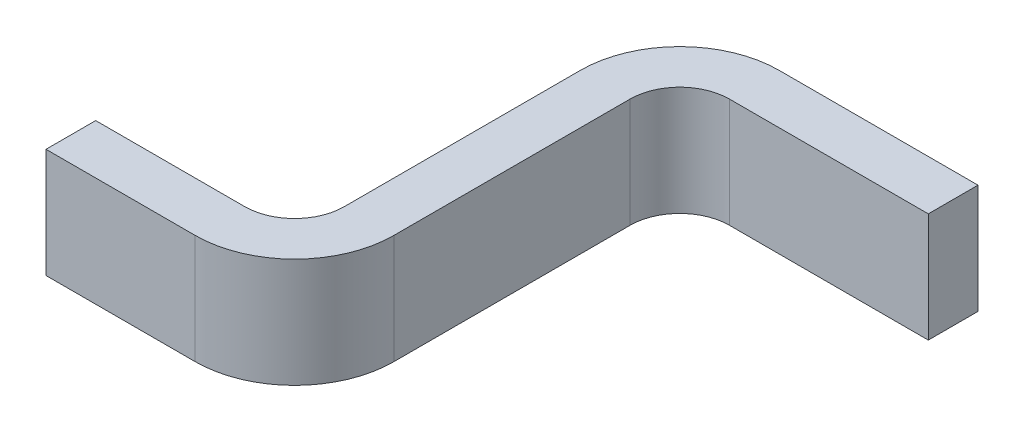
ISO-10303-21;
HEADER;
FILE_DESCRIPTION(('STEP AP214'),'2;1');
FILE_NAME('part.step','',(''),(''),'','','');
FILE_SCHEMA(('AUTOMOTIVE_DESIGN { 1 0 10303 214 1 1 1 1 }'));
ENDSEC;
DATA;
#1=APPLICATION_CONTEXT('core data for automotive mechanical design processes');
#2=APPLICATION_PROTOCOL_DEFINITION('international standard','automotive_design',2000,#1);
#3=PRODUCT_CONTEXT('',#1,'mechanical');
#4=PRODUCT('Part','Part','',(#3));
#5=PRODUCT_RELATED_PRODUCT_CATEGORY('part','',(#4));
#6=PRODUCT_DEFINITION_FORMATION('','',#4);
#7=PRODUCT_DEFINITION_CONTEXT('part definition',#1,'design');
#8=PRODUCT_DEFINITION('design','',#6,#7);
#9=PRODUCT_DEFINITION_SHAPE('','',#8);
#10=(LENGTH_UNIT() NAMED_UNIT(*) SI_UNIT(.MILLI.,.METRE.));
#11=(NAMED_UNIT(*) PLANE_ANGLE_UNIT() SI_UNIT($,.RADIAN.));
#12=(NAMED_UNIT(*) SI_UNIT($,.STERADIAN.) SOLID_ANGLE_UNIT());
#13=UNCERTAINTY_MEASURE_WITH_UNIT(LENGTH_MEASURE(1.E-05),#10,'distance_accuracy_value','');
#14=(GEOMETRIC_REPRESENTATION_CONTEXT(3) GLOBAL_UNCERTAINTY_ASSIGNED_CONTEXT((#13)) GLOBAL_UNIT_ASSIGNED_CONTEXT((#10,
#11,#12)) REPRESENTATION_CONTEXT('',''));
#15=CARTESIAN_POINT('',(0.,0.,0.));
#16=DIRECTION('',(0.,0.,1.));
#17=DIRECTION('',(1.,0.,0.));
#18=AXIS2_PLACEMENT_3D('',#15,#16,#17);
#19=CARTESIAN_POINT('',(3.90000000000001,-0.640000000000001,0.675));
#20=DIRECTION('',(0.,-1.,0.));
#21=DIRECTION('',(0.,0.,-1.));
#22=AXIS2_PLACEMENT_3D('',#19,#20,#21);
#23=PLANE('',#22);
#24=CARTESIAN_POINT('',(3.8,-0.640000000000001,0.675));
#25=DIRECTION('',(0.,-1.,0.));
#26=DIRECTION('',(0.,0.,-1.));
#27=AXIS2_PLACEMENT_3D('',#24,#25,#26);
#28=CIRCLE('',#27,0.1);
#29=CARTESIAN_POINT('',(3.90000000000001,-0.640000000000001,0.675));
#30=VERTEX_POINT('',#29);
#31=CARTESIAN_POINT('',(3.8,-0.640000000000001,0.775));
#32=VERTEX_POINT('',#31);
#33=EDGE_CURVE('E162',#30,#32,#28,.T.);
#34=ORIENTED_EDGE('',*,*,#33,.T.);
#35=DIRECTION('',(1.,0.,0.));
#36=VECTOR('',#35,1.);
#37=CARTESIAN_POINT('',(3.50000000000001,-0.64,0.775));
#38=LINE('',#37,#36);
#39=CARTESIAN_POINT('',(3.50000000000001,-0.64,0.775));
#40=VERTEX_POINT('',#39);
#41=EDGE_CURVE('E120',#32,#40,#38,.F.);
#42=ORIENTED_EDGE('',*,*,#41,.T.);
#43=DIRECTION('',(0.,0.,1.));
#44=VECTOR('',#43,1.);
#45=CARTESIAN_POINT('',(3.50000000000001,-0.64,0.775));
#46=LINE('',#45,#44);
#47=CARTESIAN_POINT('',(3.50000000000001,-0.64,0.875));
#48=VERTEX_POINT('',#47);
#49=EDGE_CURVE('E116',#48,#40,#46,.F.);
#50=ORIENTED_EDGE('',*,*,#49,.F.);
#51=DIRECTION('',(-1.,0.,0.));
#52=VECTOR('',#51,1.);
#53=CARTESIAN_POINT('',(3.50000000000001,-0.64,0.875));
#54=LINE('',#53,#52);
#55=CARTESIAN_POINT('',(3.8,-0.640000000000001,0.875));
#56=VERTEX_POINT('',#55);
#57=EDGE_CURVE('E111',#48,#56,#54,.F.);
#58=ORIENTED_EDGE('',*,*,#57,.T.);
#59=CARTESIAN_POINT('',(3.8,-0.640000000000001,0.675));
#60=DIRECTION('',(0.,-1.,0.));
#61=DIRECTION('',(0.,0.,-1.));
#62=AXIS2_PLACEMENT_3D('',#59,#60,#61);
#63=CIRCLE('',#62,0.2);
#64=CARTESIAN_POINT('',(4.,-0.64,0.675));
#65=VERTEX_POINT('',#64);
#66=EDGE_CURVE('E102',#65,#56,#63,.T.);
#67=ORIENTED_EDGE('',*,*,#66,.F.);
#68=DIRECTION('',(0.,0.,1.));
#69=VECTOR('',#68,1.);
#70=CARTESIAN_POINT('',(4.,-0.64,0.675));
#71=LINE('',#70,#69);
#72=CARTESIAN_POINT('',(4.,-0.64,0.2));
#73=VERTEX_POINT('',#72);
#74=EDGE_CURVE('E98',#65,#73,#71,.F.);
#75=ORIENTED_EDGE('',*,*,#74,.T.);
#76=CARTESIAN_POINT('',(4.1,-0.64,0.2));
#77=DIRECTION('',(0.,1.,0.));
#78=DIRECTION('',(0.,0.,1.));
#79=AXIS2_PLACEMENT_3D('',#76,#77,#78);
#80=CIRCLE('',#79,0.1);
#81=CARTESIAN_POINT('',(4.1,-0.64,0.1));
#82=VERTEX_POINT('',#81);
#83=EDGE_CURVE('E20',#73,#82,#80,.F.);
#84=ORIENTED_EDGE('',*,*,#83,.T.);
#85=DIRECTION('',(-1.,0.,0.));
#86=VECTOR('',#85,1.);
#87=CARTESIAN_POINT('',(4.1,-0.64,0.1));
#88=LINE('',#87,#86);
#89=CARTESIAN_POINT('',(4.5,-0.64,0.1));
#90=VERTEX_POINT('',#89);
#91=EDGE_CURVE('E145',#82,#90,#88,.F.);
#92=ORIENTED_EDGE('',*,*,#91,.T.);
#93=DIRECTION('',(0.,0.,1.));
#94=VECTOR('',#93,1.);
#95=CARTESIAN_POINT('',(4.5,-0.64,0.));
#96=LINE('',#95,#94);
#97=CARTESIAN_POINT('',(4.5,-0.64,0.));
#98=VERTEX_POINT('',#97);
#99=EDGE_CURVE('E139',#90,#98,#96,.F.);
#100=ORIENTED_EDGE('',*,*,#99,.T.);
#101=DIRECTION('',(1.,0.,0.));
#102=VECTOR('',#101,1.);
#103=CARTESIAN_POINT('',(4.1,-0.64,0.));
#104=LINE('',#103,#102);
#105=CARTESIAN_POINT('',(4.1,-0.64,0.));
#106=VERTEX_POINT('',#105);
#107=EDGE_CURVE('E132',#98,#106,#104,.F.);
#108=ORIENTED_EDGE('',*,*,#107,.T.);
#109=CARTESIAN_POINT('',(4.1,-0.64,0.2));
#110=DIRECTION('',(0.,1.,0.));
#111=DIRECTION('',(0.,0.,1.));
#112=AXIS2_PLACEMENT_3D('',#109,#110,#111);
#113=CIRCLE('',#112,0.2);
#114=CARTESIAN_POINT('',(3.90000000000001,-0.640000000000001,0.2));
#115=VERTEX_POINT('',#114);
#116=EDGE_CURVE('E135',#115,#106,#113,.F.);
#117=ORIENTED_EDGE('',*,*,#116,.F.);
#118=DIRECTION('',(0.,0.,-1.));
#119=VECTOR('',#118,1.);
#120=CARTESIAN_POINT('',(3.90000000000001,-0.640000000000001,0.675));
#121=LINE('',#120,#119);
#122=EDGE_CURVE('E128',#115,#30,#121,.F.);
#123=ORIENTED_EDGE('',*,*,#122,.T.);
#124=EDGE_LOOP('',(#34,#42,#50,#58,#67,#75,#84,#92,#100,#108,#117,#123));
#125=FACE_BOUND('',#124,.T.);
#126=ADVANCED_FACE('F17',(#125),#23,.F.);
#127=CARTESIAN_POINT('',(4.1,-0.64,0.2));
#128=DIRECTION('',(0.,1.,0.));
#129=DIRECTION('',(0.,0.,1.));
#130=AXIS2_PLACEMENT_3D('',#127,#128,#129);
#131=CYLINDRICAL_SURFACE('',#130,0.1);
#132=DIRECTION('',(0.,1.,0.));
#133=VECTOR('',#132,1.);
#134=CARTESIAN_POINT('',(4.,-0.64,0.2));
#135=LINE('',#134,#133);
#136=CARTESIAN_POINT('',(4.,-0.86,0.2));
#137=VERTEX_POINT('',#136);
#138=EDGE_CURVE('E91',#73,#137,#135,.F.);
#139=ORIENTED_EDGE('',*,*,#138,.T.);
#140=CARTESIAN_POINT('',(4.1,-0.86,0.2));
#141=DIRECTION('',(0.,1.,0.));
#142=DIRECTION('',(0.,0.,1.));
#143=AXIS2_PLACEMENT_3D('',#140,#141,#142);
#144=CIRCLE('',#143,0.1);
#145=CARTESIAN_POINT('',(4.1,-0.86,0.1));
#146=VERTEX_POINT('',#145);
#147=EDGE_CURVE('E103',#137,#146,#144,.F.);
#148=ORIENTED_EDGE('',*,*,#147,.T.);
#149=DIRECTION('',(0.,1.,0.));
#150=VECTOR('',#149,1.);
#151=CARTESIAN_POINT('',(4.1,-0.64,0.1));
#152=LINE('',#151,#150);
#153=EDGE_CURVE('E92',#146,#82,#152,.T.);
#154=ORIENTED_EDGE('',*,*,#153,.T.);
#155=ORIENTED_EDGE('',*,*,#83,.F.);
#156=EDGE_LOOP('',(#139,#148,#154,#155));
#157=FACE_BOUND('',#156,.T.);
#158=ADVANCED_FACE('F89',(#157),#131,.F.);
#159=CARTESIAN_POINT('',(4.1,-0.64,0.1));
#160=DIRECTION('',(0.,0.,-1.));
#161=DIRECTION('',(-1.,0.,0.));
#162=AXIS2_PLACEMENT_3D('',#159,#160,#161);
#163=PLANE('',#162);
#164=ORIENTED_EDGE('',*,*,#153,.F.);
#165=DIRECTION('',(1.,0.,0.));
#166=VECTOR('',#165,1.);
#167=CARTESIAN_POINT('',(4.,-0.86,0.1));
#168=LINE('',#167,#166);
#169=CARTESIAN_POINT('',(4.5,-0.86,0.1));
#170=VERTEX_POINT('',#169);
#171=EDGE_CURVE('E105',#146,#170,#168,.T.);
#172=ORIENTED_EDGE('',*,*,#171,.T.);
#173=DIRECTION('',(0.,1.,0.));
#174=VECTOR('',#173,1.);
#175=CARTESIAN_POINT('',(4.5,-0.86,0.1));
#176=LINE('',#175,#174);
#177=EDGE_CURVE('E142',#170,#90,#176,.T.);
#178=ORIENTED_EDGE('',*,*,#177,.T.);
#179=ORIENTED_EDGE('',*,*,#91,.F.);
#180=EDGE_LOOP('',(#164,#172,#178,#179));
#181=FACE_BOUND('',#180,.T.);
#182=ADVANCED_FACE('F187',(#181),#163,.F.);
#183=CARTESIAN_POINT('',(4.5,-0.86,0.));
#184=DIRECTION('',(-1.,0.,0.));
#185=DIRECTION('',(0.,0.,1.));
#186=AXIS2_PLACEMENT_3D('',#183,#184,#185);
#187=PLANE('',#186);
#188=ORIENTED_EDGE('',*,*,#177,.F.);
#189=DIRECTION('',(0.,0.,1.));
#190=VECTOR('',#189,1.);
#191=CARTESIAN_POINT('',(4.5,-0.86,0.675));
#192=LINE('',#191,#190);
#193=CARTESIAN_POINT('',(4.5,-0.86,0.));
#194=VERTEX_POINT('',#193);
#195=EDGE_CURVE('E176',#170,#194,#192,.F.);
#196=ORIENTED_EDGE('',*,*,#195,.T.);
#197=DIRECTION('',(0.,1.,0.));
#198=VECTOR('',#197,1.);
#199=CARTESIAN_POINT('',(4.5,-0.86,0.));
#200=LINE('',#199,#198);
#201=EDGE_CURVE('E136',#194,#98,#200,.T.);
#202=ORIENTED_EDGE('',*,*,#201,.T.);
#203=ORIENTED_EDGE('',*,*,#99,.F.);
#204=EDGE_LOOP('',(#188,#196,#202,#203));
#205=FACE_BOUND('',#204,.T.);
#206=ADVANCED_FACE('F192',(#205),#187,.F.);
#207=CARTESIAN_POINT('',(4.1,-0.86,0.));
#208=DIRECTION('',(0.,0.,1.));
#209=DIRECTION('',(1.,0.,0.));
#210=AXIS2_PLACEMENT_3D('',#207,#208,#209);
#211=PLANE('',#210);
#212=DIRECTION('',(0.,1.,0.));
#213=VECTOR('',#212,1.);
#214=CARTESIAN_POINT('',(4.1,-0.86,0.));
#215=LINE('',#214,#213);
#216=CARTESIAN_POINT('',(4.1,-0.86,0.));
#217=VERTEX_POINT('',#216);
#218=EDGE_CURVE('E163',#106,#217,#215,.F.);
#219=ORIENTED_EDGE('',*,*,#218,.F.);
#220=ORIENTED_EDGE('',*,*,#107,.F.);
#221=ORIENTED_EDGE('',*,*,#201,.F.);
#222=DIRECTION('',(1.,0.,0.));
#223=VECTOR('',#222,1.);
#224=CARTESIAN_POINT('',(4.,-0.86,0.));
#225=LINE('',#224,#223);
#226=EDGE_CURVE('E159',#194,#217,#225,.F.);
#227=ORIENTED_EDGE('',*,*,#226,.T.);
#228=EDGE_LOOP('',(#219,#220,#221,#227));
#229=FACE_BOUND('',#228,.T.);
#230=ADVANCED_FACE('F264',(#229),#211,.F.);
#231=CARTESIAN_POINT('',(4.1,-0.86,0.2));
#232=DIRECTION('',(0.,1.,0.));
#233=DIRECTION('',(0.,0.,1.));
#234=AXIS2_PLACEMENT_3D('',#231,#232,#233);
#235=CYLINDRICAL_SURFACE('',#234,0.2);
#236=ORIENTED_EDGE('',*,*,#116,.T.);
#237=ORIENTED_EDGE('',*,*,#218,.T.);
#238=CARTESIAN_POINT('',(4.1,-0.86,0.2));
#239=DIRECTION('',(0.,1.,0.));
#240=DIRECTION('',(0.,0.,1.));
#241=AXIS2_PLACEMENT_3D('',#238,#239,#240);
#242=CIRCLE('',#241,0.2);
#243=CARTESIAN_POINT('',(3.90000000000001,-0.860000000000001,0.2));
#244=VERTEX_POINT('',#243);
#245=EDGE_CURVE('E157',#217,#244,#242,.T.);
#246=ORIENTED_EDGE('',*,*,#245,.T.);
#247=DIRECTION('',(0.,1.,0.));
#248=VECTOR('',#247,1.);
#249=CARTESIAN_POINT('',(3.90000000000001,-0.860000000000001,0.2));
#250=LINE('',#249,#248);
#251=EDGE_CURVE('E131',#244,#115,#250,.T.);
#252=ORIENTED_EDGE('',*,*,#251,.T.);
#253=EDGE_LOOP('',(#236,#237,#246,#252));
#254=FACE_BOUND('',#253,.T.);
#255=ADVANCED_FACE('F266',(#254),#235,.T.);
#256=CARTESIAN_POINT('',(3.90000000000001,-0.860000000000001,0.675));
#257=DIRECTION('',(1.,0.,0.));
#258=DIRECTION('',(0.,0.,-1.));
#259=AXIS2_PLACEMENT_3D('',#256,#257,#258);
#260=PLANE('',#259);
#261=DIRECTION('',(0.,-1.,0.));
#262=VECTOR('',#261,1.);
#263=CARTESIAN_POINT('',(3.90000000000001,-0.860000000000001,0.675));
#264=LINE('',#263,#262);
#265=CARTESIAN_POINT('',(3.90000000000001,-0.860000000000001,0.675));
#266=VERTEX_POINT('',#265);
#267=EDGE_CURVE('E130',#266,#30,#264,.F.);
#268=ORIENTED_EDGE('',*,*,#267,.T.);
#269=ORIENTED_EDGE('',*,*,#122,.F.);
#270=ORIENTED_EDGE('',*,*,#251,.F.);
#271=DIRECTION('',(0.,0.,1.));
#272=VECTOR('',#271,1.);
#273=CARTESIAN_POINT('',(3.90000000000001,-0.860000000000001,0.675));
#274=LINE('',#273,#272);
#275=EDGE_CURVE('E156',#244,#266,#274,.T.);
#276=ORIENTED_EDGE('',*,*,#275,.T.);
#277=EDGE_LOOP('',(#268,#269,#270,#276));
#278=FACE_BOUND('',#277,.T.);
#279=ADVANCED_FACE('F231',(#278),#260,.F.);
#280=CARTESIAN_POINT('',(3.8,-0.860000000000001,0.675));
#281=DIRECTION('',(0.,-1.,0.));
#282=DIRECTION('',(0.,0.,-1.));
#283=AXIS2_PLACEMENT_3D('',#280,#281,#282);
#284=CYLINDRICAL_SURFACE('',#283,0.1);
#285=DIRECTION('',(0.,1.,0.));
#286=VECTOR('',#285,1.);
#287=CARTESIAN_POINT('',(3.8,-0.860000000000001,0.775));
#288=LINE('',#287,#286);
#289=CARTESIAN_POINT('',(3.8,-0.860000000000001,0.775));
#290=VERTEX_POINT('',#289);
#291=EDGE_CURVE('E125',#290,#32,#288,.T.);
#292=ORIENTED_EDGE('',*,*,#291,.T.);
#293=ORIENTED_EDGE('',*,*,#33,.F.);
#294=ORIENTED_EDGE('',*,*,#267,.F.);
#295=CARTESIAN_POINT('',(3.8,-0.860000000000001,0.675));
#296=DIRECTION('',(0.,-1.,0.));
#297=DIRECTION('',(0.,0.,-1.));
#298=AXIS2_PLACEMENT_3D('',#295,#296,#297);
#299=CIRCLE('',#298,0.1);
#300=EDGE_CURVE('E152',#266,#290,#299,.T.);
#301=ORIENTED_EDGE('',*,*,#300,.T.);
#302=EDGE_LOOP('',(#292,#293,#294,#301));
#303=FACE_BOUND('',#302,.T.);
#304=ADVANCED_FACE('F235',(#303),#284,.F.);
#305=CARTESIAN_POINT('',(3.50000000000001,-0.86,0.775));
#306=DIRECTION('',(0.,0.,1.));
#307=DIRECTION('',(1.,0.,0.));
#308=AXIS2_PLACEMENT_3D('',#305,#306,#307);
#309=PLANE('',#308);
#310=DIRECTION('',(0.,1.,0.));
#311=VECTOR('',#310,1.);
#312=CARTESIAN_POINT('',(3.50000000000001,-0.86,0.775));
#313=LINE('',#312,#311);
#314=CARTESIAN_POINT('',(3.50000000000001,-0.86,0.775));
#315=VERTEX_POINT('',#314);
#316=EDGE_CURVE('E119',#40,#315,#313,.F.);
#317=ORIENTED_EDGE('',*,*,#316,.F.);
#318=ORIENTED_EDGE('',*,*,#41,.F.);
#319=ORIENTED_EDGE('',*,*,#291,.F.);
#320=DIRECTION('',(1.,0.,0.));
#321=VECTOR('',#320,1.);
#322=CARTESIAN_POINT('',(4.,-0.86,0.775));
#323=LINE('',#322,#321);
#324=EDGE_CURVE('E155',#290,#315,#323,.F.);
#325=ORIENTED_EDGE('',*,*,#324,.T.);
#326=EDGE_LOOP('',(#317,#318,#319,#325));
#327=FACE_BOUND('',#326,.T.);
#328=ADVANCED_FACE('F259',(#327),#309,.F.);
#329=CARTESIAN_POINT('',(3.50000000000001,-0.86,0.775));
#330=DIRECTION('',(-1.,0.,0.));
#331=DIRECTION('',(0.,0.,1.));
#332=AXIS2_PLACEMENT_3D('',#329,#330,#331);
#333=PLANE('',#332);
#334=DIRECTION('',(0.,0.,1.));
#335=VECTOR('',#334,1.);
#336=CARTESIAN_POINT('',(3.50000000000001,-0.86,0.675));
#337=LINE('',#336,#335);
#338=CARTESIAN_POINT('',(3.50000000000001,-0.86,0.875));
#339=VERTEX_POINT('',#338);
#340=EDGE_CURVE('E217',#315,#339,#337,.T.);
#341=ORIENTED_EDGE('',*,*,#340,.T.);
#342=DIRECTION('',(0.,1.,0.));
#343=VECTOR('',#342,1.);
#344=CARTESIAN_POINT('',(3.50000000000001,-0.64,0.875));
#345=LINE('',#344,#343);
#346=EDGE_CURVE('E113',#339,#48,#345,.T.);
#347=ORIENTED_EDGE('',*,*,#346,.T.);
#348=ORIENTED_EDGE('',*,*,#49,.T.);
#349=ORIENTED_EDGE('',*,*,#316,.T.);
#350=EDGE_LOOP('',(#341,#347,#348,#349));
#351=FACE_BOUND('',#350,.T.);
#352=ADVANCED_FACE('F255',(#351),#333,.T.);
#353=CARTESIAN_POINT('',(3.50000000000001,-0.64,0.875));
#354=DIRECTION('',(0.,0.,-1.));
#355=DIRECTION('',(-1.,0.,0.));
#356=AXIS2_PLACEMENT_3D('',#353,#354,#355);
#357=PLANE('',#356);
#358=ORIENTED_EDGE('',*,*,#346,.F.);
#359=DIRECTION('',(1.,0.,0.));
#360=VECTOR('',#359,1.);
#361=CARTESIAN_POINT('',(4.,-0.86,0.875));
#362=LINE('',#361,#360);
#363=CARTESIAN_POINT('',(3.8,-0.860000000000001,0.875));
#364=VERTEX_POINT('',#363);
#365=EDGE_CURVE('E151',#339,#364,#362,.T.);
#366=ORIENTED_EDGE('',*,*,#365,.T.);
#367=DIRECTION('',(0.,-1.,0.));
#368=VECTOR('',#367,1.);
#369=CARTESIAN_POINT('',(3.8,-0.640000000000001,0.875));
#370=LINE('',#369,#368);
#371=EDGE_CURVE('E99',#56,#364,#370,.T.);
#372=ORIENTED_EDGE('',*,*,#371,.F.);
#373=ORIENTED_EDGE('',*,*,#57,.F.);
#374=EDGE_LOOP('',(#358,#366,#372,#373));
#375=FACE_BOUND('',#374,.T.);
#376=ADVANCED_FACE('F251',(#375),#357,.F.);
#377=CARTESIAN_POINT('',(3.8,-0.640000000000001,0.675));
#378=DIRECTION('',(0.,-1.,0.));
#379=DIRECTION('',(0.,0.,-1.));
#380=AXIS2_PLACEMENT_3D('',#377,#378,#379);
#381=CYLINDRICAL_SURFACE('',#380,0.2);
#382=CARTESIAN_POINT('',(3.8,-0.860000000000001,0.675));
#383=DIRECTION('',(0.,-1.,0.));
#384=DIRECTION('',(0.,0.,-1.));
#385=AXIS2_PLACEMENT_3D('',#382,#383,#384);
#386=CIRCLE('',#385,0.2);
#387=CARTESIAN_POINT('',(4.,-0.86,0.675));
#388=VERTEX_POINT('',#387);
#389=EDGE_CURVE('E26',#364,#388,#386,.F.);
#390=ORIENTED_EDGE('',*,*,#389,.T.);
#391=DIRECTION('',(0.,1.,0.));
#392=VECTOR('',#391,1.);
#393=CARTESIAN_POINT('',(4.,-0.64,0.675));
#394=LINE('',#393,#392);
#395=EDGE_CURVE('E34',#388,#65,#394,.T.);
#396=ORIENTED_EDGE('',*,*,#395,.T.);
#397=ORIENTED_EDGE('',*,*,#66,.T.);
#398=ORIENTED_EDGE('',*,*,#371,.T.);
#399=EDGE_LOOP('',(#390,#396,#397,#398));
#400=FACE_BOUND('',#399,.T.);
#401=ADVANCED_FACE('F280',(#400),#381,.T.);
#402=CARTESIAN_POINT('',(4.,-0.64,0.675));
#403=DIRECTION('',(-1.,0.,0.));
#404=DIRECTION('',(0.,0.,1.));
#405=AXIS2_PLACEMENT_3D('',#402,#403,#404);
#406=PLANE('',#405);
#407=ORIENTED_EDGE('',*,*,#395,.F.);
#408=DIRECTION('',(0.,0.,1.));
#409=VECTOR('',#408,1.);
#410=CARTESIAN_POINT('',(4.,-0.86,0.675));
#411=LINE('',#410,#409);
#412=EDGE_CURVE('E11',#388,#137,#411,.F.);
#413=ORIENTED_EDGE('',*,*,#412,.T.);
#414=ORIENTED_EDGE('',*,*,#138,.F.);
#415=ORIENTED_EDGE('',*,*,#74,.F.);
#416=EDGE_LOOP('',(#407,#413,#414,#415));
#417=FACE_BOUND('',#416,.T.);
#418=ADVANCED_FACE('F97',(#417),#406,.F.);
#419=CARTESIAN_POINT('',(4.,-0.86,0.675));
#420=DIRECTION('',(0.,1.,0.));
#421=DIRECTION('',(0.,0.,1.));
#422=AXIS2_PLACEMENT_3D('',#419,#420,#421);
#423=PLANE('',#422);
#424=ORIENTED_EDGE('',*,*,#389,.F.);
#425=ORIENTED_EDGE('',*,*,#365,.F.);
#426=ORIENTED_EDGE('',*,*,#340,.F.);
#427=ORIENTED_EDGE('',*,*,#324,.F.);
#428=ORIENTED_EDGE('',*,*,#300,.F.);
#429=ORIENTED_EDGE('',*,*,#275,.F.);
#430=ORIENTED_EDGE('',*,*,#245,.F.);
#431=ORIENTED_EDGE('',*,*,#226,.F.);
#432=ORIENTED_EDGE('',*,*,#195,.F.);
#433=ORIENTED_EDGE('',*,*,#171,.F.);
#434=ORIENTED_EDGE('',*,*,#147,.F.);
#435=ORIENTED_EDGE('',*,*,#412,.F.);
#436=EDGE_LOOP('',(#424,#425,#426,#427,#428,#429,#430,#431,#432,#433,#434,#435));
#437=FACE_BOUND('',#436,.T.);
#438=ADVANCED_FACE('F197',(#437),#423,.F.);
#439=CLOSED_SHELL('',(#126,#158,#182,#206,#230,#255,#279,#304,#328,#352,#376,#401,#418,#438));
#440=MANIFOLD_SOLID_BREP('B1',#439);
#441=ADVANCED_BREP_SHAPE_REPRESENTATION('',(#18,#440),#14);
#442=SHAPE_DEFINITION_REPRESENTATION(#9,#441);
ENDSEC;
END-ISO-10303-21;
